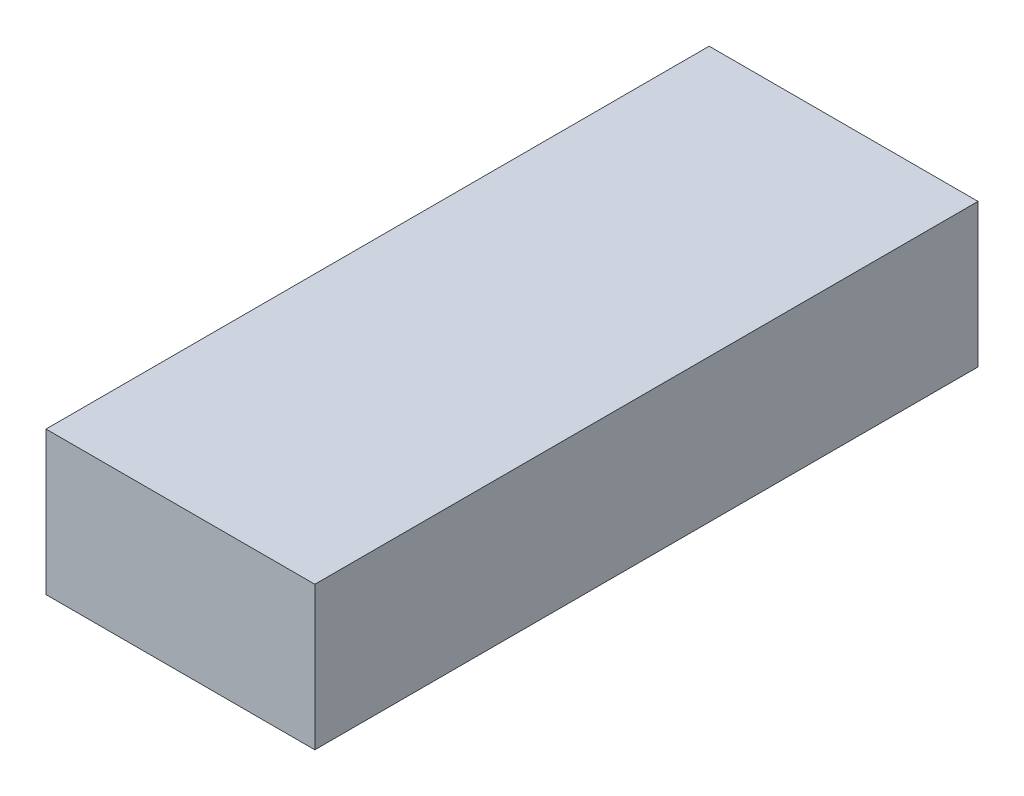
ISO-10303-21;
HEADER;
FILE_DESCRIPTION(('STEP AP214'),'2;1');
FILE_NAME('part.step','',(''),(''),'','','');
FILE_SCHEMA(('AUTOMOTIVE_DESIGN { 1 0 10303 214 1 1 1 1 }'));
ENDSEC;
DATA;
#1=APPLICATION_CONTEXT('core data for automotive mechanical design processes');
#2=APPLICATION_PROTOCOL_DEFINITION('international standard','automotive_design',2000,#1);
#3=PRODUCT_CONTEXT('',#1,'mechanical');
#4=PRODUCT('Part','Part','',(#3));
#5=PRODUCT_RELATED_PRODUCT_CATEGORY('part','',(#4));
#6=PRODUCT_DEFINITION_FORMATION('','',#4);
#7=PRODUCT_DEFINITION_CONTEXT('part definition',#1,'design');
#8=PRODUCT_DEFINITION('design','',#6,#7);
#9=PRODUCT_DEFINITION_SHAPE('','',#8);
#10=(LENGTH_UNIT() NAMED_UNIT(*) SI_UNIT(.MILLI.,.METRE.));
#11=(NAMED_UNIT(*) PLANE_ANGLE_UNIT() SI_UNIT($,.RADIAN.));
#12=(NAMED_UNIT(*) SI_UNIT($,.STERADIAN.) SOLID_ANGLE_UNIT());
#13=UNCERTAINTY_MEASURE_WITH_UNIT(LENGTH_MEASURE(1.E-05),#10,'distance_accuracy_value','');
#14=(GEOMETRIC_REPRESENTATION_CONTEXT(3) GLOBAL_UNCERTAINTY_ASSIGNED_CONTEXT((#13)) GLOBAL_UNIT_ASSIGNED_CONTEXT((#10,
#11,#12)) REPRESENTATION_CONTEXT('',''));
#15=CARTESIAN_POINT('',(0.,0.,0.));
#16=DIRECTION('',(0.,0.,1.));
#17=DIRECTION('',(1.,0.,0.));
#18=AXIS2_PLACEMENT_3D('',#15,#16,#17);
#19=CARTESIAN_POINT('',(0.,8.,0.));
#20=DIRECTION('',(1.,0.,0.));
#21=DIRECTION('',(0.,0.,-1.));
#22=AXIS2_PLACEMENT_3D('',#19,#20,#21);
#23=PLANE('',#22);
#24=DIRECTION('',(0.,0.,1.));
#25=VECTOR('',#24,1.);
#26=CARTESIAN_POINT('',(0.,0.,0.));
#27=LINE('',#26,#25);
#28=CARTESIAN_POINT('',(0.,0.,-37.));
#29=VERTEX_POINT('',#28);
#30=CARTESIAN_POINT('',(0.,0.,0.));
#31=VERTEX_POINT('',#30);
#32=EDGE_CURVE('E99',#29,#31,#27,.T.);
#33=ORIENTED_EDGE('',*,*,#32,.T.);
#34=DIRECTION('',(0.,-1.,0.));
#35=VECTOR('',#34,1.);
#36=CARTESIAN_POINT('',(0.,8.,0.));
#37=LINE('',#36,#35);
#38=CARTESIAN_POINT('',(0.,8.,0.));
#39=VERTEX_POINT('',#38);
#40=EDGE_CURVE('E11',#39,#31,#37,.T.);
#41=ORIENTED_EDGE('',*,*,#40,.F.);
#42=DIRECTION('',(0.,0.,1.));
#43=VECTOR('',#42,1.);
#44=CARTESIAN_POINT('',(0.,8.,0.));
#45=LINE('',#44,#43);
#46=CARTESIAN_POINT('',(0.,8.,-37.));
#47=VERTEX_POINT('',#46);
#48=EDGE_CURVE('E87',#47,#39,#45,.T.);
#49=ORIENTED_EDGE('',*,*,#48,.F.);
#50=DIRECTION('',(0.,-1.,0.));
#51=VECTOR('',#50,1.);
#52=CARTESIAN_POINT('',(0.,8.,-37.));
#53=LINE('',#52,#51);
#54=EDGE_CURVE('E95',#47,#29,#53,.T.);
#55=ORIENTED_EDGE('',*,*,#54,.T.);
#56=EDGE_LOOP('',(#33,#41,#49,#55));
#57=FACE_BOUND('',#56,.T.);
#58=ADVANCED_FACE('F36',(#57),#23,.F.);
#59=CARTESIAN_POINT('',(0.,8.,0.));
#60=DIRECTION('',(0.,0.,-1.));
#61=DIRECTION('',(-1.,0.,0.));
#62=AXIS2_PLACEMENT_3D('',#59,#60,#61);
#63=PLANE('',#62);
#64=DIRECTION('',(1.,0.,0.));
#65=VECTOR('',#64,1.);
#66=CARTESIAN_POINT('',(0.,0.,0.));
#67=LINE('',#66,#65);
#68=CARTESIAN_POINT('',(15.,0.,0.));
#69=VERTEX_POINT('',#68);
#70=EDGE_CURVE('E91',#31,#69,#67,.T.);
#71=ORIENTED_EDGE('',*,*,#70,.T.);
#72=DIRECTION('',(0.,-1.,0.));
#73=VECTOR('',#72,1.);
#74=CARTESIAN_POINT('',(15.,8.,0.));
#75=LINE('',#74,#73);
#76=CARTESIAN_POINT('',(15.,8.,0.));
#77=VERTEX_POINT('',#76);
#78=EDGE_CURVE('E44',#77,#69,#75,.T.);
#79=ORIENTED_EDGE('',*,*,#78,.F.);
#80=DIRECTION('',(1.,0.,0.));
#81=VECTOR('',#80,1.);
#82=CARTESIAN_POINT('',(0.,8.,0.));
#83=LINE('',#82,#81);
#84=EDGE_CURVE('E82',#39,#77,#83,.T.);
#85=ORIENTED_EDGE('',*,*,#84,.F.);
#86=ORIENTED_EDGE('',*,*,#40,.T.);
#87=EDGE_LOOP('',(#71,#79,#85,#86));
#88=FACE_BOUND('',#87,.T.);
#89=ADVANCED_FACE('F90',(#88),#63,.F.);
#90=CARTESIAN_POINT('',(15.,8.,0.));
#91=DIRECTION('',(-1.,0.,0.));
#92=DIRECTION('',(0.,0.,1.));
#93=AXIS2_PLACEMENT_3D('',#90,#91,#92);
#94=PLANE('',#93);
#95=DIRECTION('',(0.,0.,-1.));
#96=VECTOR('',#95,1.);
#97=CARTESIAN_POINT('',(15.,0.,0.));
#98=LINE('',#97,#96);
#99=CARTESIAN_POINT('',(15.,0.,-37.));
#100=VERTEX_POINT('',#99);
#101=EDGE_CURVE('E69',#69,#100,#98,.T.);
#102=ORIENTED_EDGE('',*,*,#101,.T.);
#103=DIRECTION('',(0.,-1.,0.));
#104=VECTOR('',#103,1.);
#105=CARTESIAN_POINT('',(15.,8.,-37.));
#106=LINE('',#105,#104);
#107=CARTESIAN_POINT('',(15.,8.,-37.));
#108=VERTEX_POINT('',#107);
#109=EDGE_CURVE('E92',#108,#100,#106,.T.);
#110=ORIENTED_EDGE('',*,*,#109,.F.);
#111=DIRECTION('',(0.,0.,-1.));
#112=VECTOR('',#111,1.);
#113=CARTESIAN_POINT('',(15.,8.,0.));
#114=LINE('',#113,#112);
#115=EDGE_CURVE('E85',#77,#108,#114,.T.);
#116=ORIENTED_EDGE('',*,*,#115,.F.);
#117=ORIENTED_EDGE('',*,*,#78,.T.);
#118=EDGE_LOOP('',(#102,#110,#116,#117));
#119=FACE_BOUND('',#118,.T.);
#120=ADVANCED_FACE('F93',(#119),#94,.F.);
#121=CARTESIAN_POINT('',(0.,8.,-37.));
#122=DIRECTION('',(0.,0.,1.));
#123=DIRECTION('',(1.,0.,0.));
#124=AXIS2_PLACEMENT_3D('',#121,#122,#123);
#125=PLANE('',#124);
#126=DIRECTION('',(-1.,0.,0.));
#127=VECTOR('',#126,1.);
#128=CARTESIAN_POINT('',(0.,0.,-37.));
#129=LINE('',#128,#127);
#130=EDGE_CURVE('E75',#100,#29,#129,.T.);
#131=ORIENTED_EDGE('',*,*,#130,.T.);
#132=ORIENTED_EDGE('',*,*,#54,.F.);
#133=DIRECTION('',(-1.,0.,0.));
#134=VECTOR('',#133,1.);
#135=CARTESIAN_POINT('',(0.,8.,-37.));
#136=LINE('',#135,#134);
#137=EDGE_CURVE('E52',#108,#47,#136,.T.);
#138=ORIENTED_EDGE('',*,*,#137,.F.);
#139=ORIENTED_EDGE('',*,*,#109,.T.);
#140=EDGE_LOOP('',(#131,#132,#138,#139));
#141=FACE_BOUND('',#140,.T.);
#142=ADVANCED_FACE('F106',(#141),#125,.F.);
#143=CARTESIAN_POINT('',(0.,8.,0.));
#144=DIRECTION('',(0.,-1.,0.));
#145=DIRECTION('',(0.,0.,-1.));
#146=AXIS2_PLACEMENT_3D('',#143,#144,#145);
#147=PLANE('',#146);
#148=ORIENTED_EDGE('',*,*,#48,.T.);
#149=ORIENTED_EDGE('',*,*,#84,.T.);
#150=ORIENTED_EDGE('',*,*,#115,.T.);
#151=ORIENTED_EDGE('',*,*,#137,.T.);
#152=EDGE_LOOP('',(#148,#149,#150,#151));
#153=FACE_BOUND('',#152,.T.);
#154=ADVANCED_FACE('F83',(#153),#147,.F.);
#155=CARTESIAN_POINT('',(0.,0.,0.));
#156=DIRECTION('',(0.,-1.,0.));
#157=DIRECTION('',(0.,0.,-1.));
#158=AXIS2_PLACEMENT_3D('',#155,#156,#157);
#159=PLANE('',#158);
#160=ORIENTED_EDGE('',*,*,#32,.F.);
#161=ORIENTED_EDGE('',*,*,#130,.F.);
#162=ORIENTED_EDGE('',*,*,#101,.F.);
#163=ORIENTED_EDGE('',*,*,#70,.F.);
#164=EDGE_LOOP('',(#160,#161,#162,#163));
#165=FACE_BOUND('',#164,.T.);
#166=ADVANCED_FACE('F109',(#165),#159,.T.);
#167=CLOSED_SHELL('',(#58,#89,#120,#142,#154,#166));
#168=MANIFOLD_SOLID_BREP('B2',#167);
#169=ADVANCED_BREP_SHAPE_REPRESENTATION('',(#18,#168),#14);
#170=SHAPE_DEFINITION_REPRESENTATION(#9,#169);
ENDSEC;
END-ISO-10303-21;
